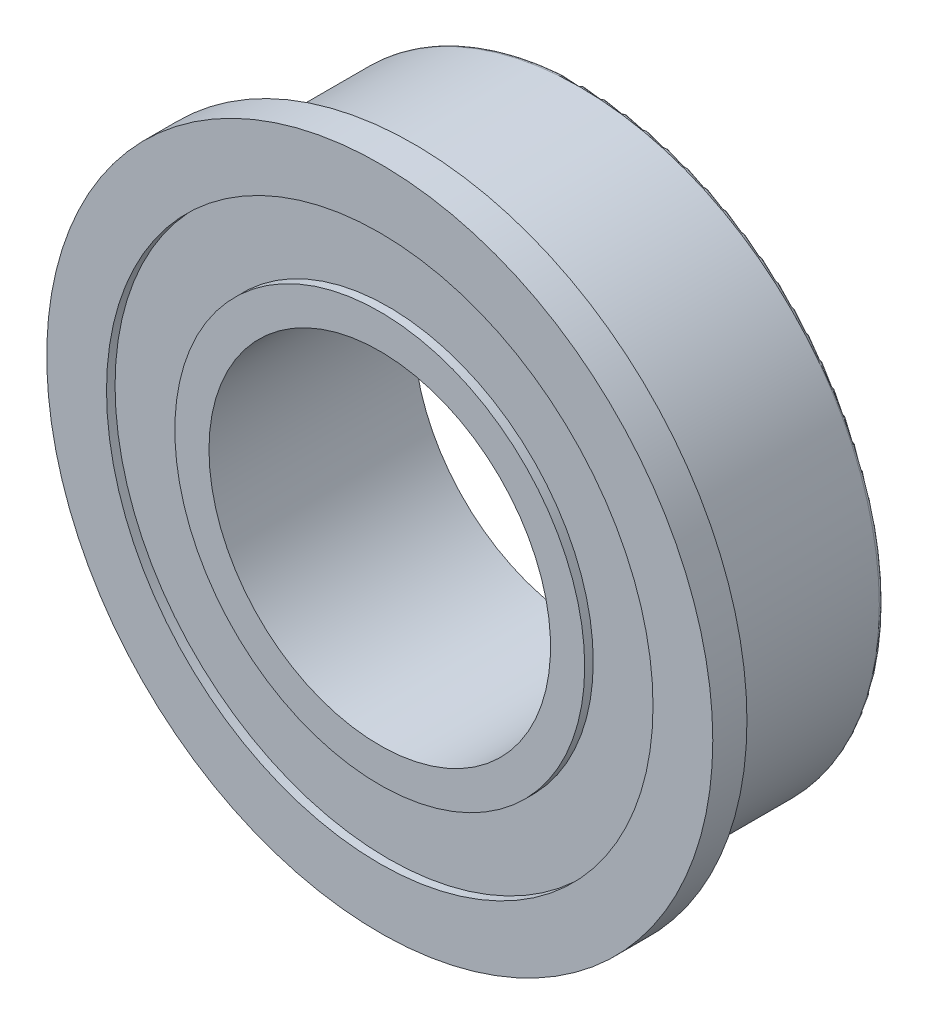
ISO-10303-21;
HEADER;
FILE_DESCRIPTION(('STEP AP214'),'2;1');
FILE_NAME('part.step','',(''),(''),'','','');
FILE_SCHEMA(('AUTOMOTIVE_DESIGN { 1 0 10303 214 1 1 1 1 }'));
ENDSEC;
DATA;
#1=APPLICATION_CONTEXT('core data for automotive mechanical design processes');
#2=APPLICATION_PROTOCOL_DEFINITION('international standard','automotive_design',2000,#1);
#3=PRODUCT_CONTEXT('',#1,'mechanical');
#4=PRODUCT('Part','Part','',(#3));
#5=PRODUCT_RELATED_PRODUCT_CATEGORY('part','',(#4));
#6=PRODUCT_DEFINITION_FORMATION('','',#4);
#7=PRODUCT_DEFINITION_CONTEXT('part definition',#1,'design');
#8=PRODUCT_DEFINITION('design','',#6,#7);
#9=PRODUCT_DEFINITION_SHAPE('','',#8);
#10=(LENGTH_UNIT() NAMED_UNIT(*) SI_UNIT(.MILLI.,.METRE.));
#11=(NAMED_UNIT(*) PLANE_ANGLE_UNIT() SI_UNIT($,.RADIAN.));
#12=(NAMED_UNIT(*) SI_UNIT($,.STERADIAN.) SOLID_ANGLE_UNIT());
#13=UNCERTAINTY_MEASURE_WITH_UNIT(LENGTH_MEASURE(1.E-05),#10,'distance_accuracy_value','');
#14=(GEOMETRIC_REPRESENTATION_CONTEXT(3) GLOBAL_UNCERTAINTY_ASSIGNED_CONTEXT((#13)) GLOBAL_UNIT_ASSIGNED_CONTEXT((#10,
#11,#12)) REPRESENTATION_CONTEXT('',''));
#15=CARTESIAN_POINT('',(0.,0.,0.));
#16=DIRECTION('',(0.,0.,1.));
#17=DIRECTION('',(1.,0.,0.));
#18=AXIS2_PLACEMENT_3D('',#15,#16,#17);
#19=CARTESIAN_POINT('',(0.,0.,4.8));
#20=DIRECTION('',(0.,0.,1.));
#21=DIRECTION('',(1.,0.,0.));
#22=AXIS2_PLACEMENT_3D('',#19,#20,#21);
#23=PLANE('',#22);
#24=CARTESIAN_POINT('',(0.,0.,4.8));
#25=DIRECTION('',(0.,0.,-1.));
#26=DIRECTION('',(-1.,0.,0.));
#27=AXIS2_PLACEMENT_3D('',#24,#25,#26);
#28=CIRCLE('',#27,4.);
#29=CARTESIAN_POINT('',(-4.,0.,4.8));
#30=VERTEX_POINT('',#29);
#31=EDGE_CURVE('E54',#30,#30,#28,.T.);
#32=ORIENTED_EDGE('',*,*,#31,.T.);
#33=EDGE_LOOP('',(#32));
#34=FACE_BOUND('',#33,.T.);
#35=CARTESIAN_POINT('',(0.,0.,4.8));
#36=DIRECTION('',(0.,0.,1.));
#37=DIRECTION('',(1.,0.,0.));
#38=AXIS2_PLACEMENT_3D('',#35,#36,#37);
#39=CIRCLE('',#38,4.8);
#40=CARTESIAN_POINT('',(4.8,0.,4.8));
#41=VERTEX_POINT('',#40);
#42=EDGE_CURVE('E81',#41,#41,#39,.T.);
#43=ORIENTED_EDGE('',*,*,#42,.T.);
#44=EDGE_LOOP('',(#43));
#45=FACE_BOUND('',#44,.T.);
#46=ADVANCED_FACE('F33',(#34,#45),#23,.T.);
#47=CARTESIAN_POINT('',(0.,0.,0.));
#48=DIRECTION('',(0.,0.,1.));
#49=DIRECTION('',(1.,0.,0.));
#50=AXIS2_PLACEMENT_3D('',#47,#48,#49);
#51=PLANE('',#50);
#52=CARTESIAN_POINT('',(0.,0.,0.));
#53=DIRECTION('',(0.,0.,-1.));
#54=DIRECTION('',(-1.,0.,0.));
#55=AXIS2_PLACEMENT_3D('',#52,#53,#54);
#56=CIRCLE('',#55,4.);
#57=CARTESIAN_POINT('',(-4.,0.,0.));
#58=VERTEX_POINT('',#57);
#59=EDGE_CURVE('E57',#58,#58,#56,.T.);
#60=ORIENTED_EDGE('',*,*,#59,.F.);
#61=EDGE_LOOP('',(#60));
#62=FACE_BOUND('',#61,.T.);
#63=CARTESIAN_POINT('',(0.,0.,0.));
#64=DIRECTION('',(0.,0.,-1.));
#65=DIRECTION('',(-1.,0.,0.));
#66=AXIS2_PLACEMENT_3D('',#63,#64,#65);
#67=CIRCLE('',#66,4.8);
#68=CARTESIAN_POINT('',(-4.8,0.,0.));
#69=VERTEX_POINT('',#68);
#70=EDGE_CURVE('E69',#69,#69,#67,.T.);
#71=ORIENTED_EDGE('',*,*,#70,.T.);
#72=EDGE_LOOP('',(#71));
#73=FACE_BOUND('',#72,.T.);
#74=ADVANCED_FACE('F124',(#62,#73),#51,.F.);
#75=CARTESIAN_POINT('',(0.,0.,4.8));
#76=DIRECTION('',(0.,0.,-1.));
#77=DIRECTION('',(-1.,0.,0.));
#78=AXIS2_PLACEMENT_3D('',#75,#76,#77);
#79=CYLINDRICAL_SURFACE('',#78,7.);
#80=CARTESIAN_POINT('',(0.,0.,0.1));
#81=DIRECTION('',(0.,0.,1.));
#82=DIRECTION('',(1.,0.,0.));
#83=AXIS2_PLACEMENT_3D('',#80,#81,#82);
#84=CIRCLE('',#83,7.);
#85=CARTESIAN_POINT('',(7.,0.,0.1));
#86=VERTEX_POINT('',#85);
#87=EDGE_CURVE('E40',#86,#86,#84,.T.);
#88=ORIENTED_EDGE('',*,*,#87,.T.);
#89=EDGE_LOOP('',(#88));
#90=FACE_BOUND('',#89,.T.);
#91=CARTESIAN_POINT('',(0.,0.,4.));
#92=DIRECTION('',(0.,0.,1.));
#93=DIRECTION('',(1.,0.,0.));
#94=AXIS2_PLACEMENT_3D('',#91,#92,#93);
#95=CIRCLE('',#94,7.);
#96=CARTESIAN_POINT('',(7.,0.,4.));
#97=VERTEX_POINT('',#96);
#98=EDGE_CURVE('E44',#97,#97,#95,.T.);
#99=ORIENTED_EDGE('',*,*,#98,.F.);
#100=EDGE_LOOP('',(#99));
#101=FACE_BOUND('',#100,.T.);
#102=ADVANCED_FACE('F122',(#90,#101),#79,.T.);
#103=CARTESIAN_POINT('',(0.,0.,0.));
#104=DIRECTION('',(0.,0.,1.));
#105=DIRECTION('',(1.,0.,0.));
#106=AXIS2_PLACEMENT_3D('',#103,#104,#105);
#107=CIRCLE('',#106,6.9);
#108=CARTESIAN_POINT('',(6.9,0.,0.));
#109=VERTEX_POINT('',#108);
#110=EDGE_CURVE('E10',#109,#109,#107,.F.);
#111=ORIENTED_EDGE('',*,*,#110,.T.);
#112=EDGE_LOOP('',(#111));
#113=FACE_BOUND('',#112,.T.);
#114=CARTESIAN_POINT('',(0.,0.,0.));
#115=DIRECTION('',(0.,0.,-1.));
#116=DIRECTION('',(-1.,0.,0.));
#117=AXIS2_PLACEMENT_3D('',#114,#115,#116);
#118=CIRCLE('',#117,6.2);
#119=CARTESIAN_POINT('',(-6.2,0.,0.));
#120=VERTEX_POINT('',#119);
#121=EDGE_CURVE('E63',#120,#120,#118,.T.);
#122=ORIENTED_EDGE('',*,*,#121,.F.);
#123=EDGE_LOOP('',(#122));
#124=FACE_BOUND('',#123,.T.);
#125=ADVANCED_FACE('F113',(#113,#124),#51,.F.);
#126=CARTESIAN_POINT('',(0.,0.,4.));
#127=DIRECTION('',(0.,0.,1.));
#128=DIRECTION('',(1.,0.,0.));
#129=AXIS2_PLACEMENT_3D('',#126,#127,#128);
#130=CYLINDRICAL_SURFACE('',#129,7.8);
#131=CARTESIAN_POINT('',(0.,0.,4.));
#132=DIRECTION('',(0.,0.,1.));
#133=DIRECTION('',(1.,0.,0.));
#134=AXIS2_PLACEMENT_3D('',#131,#132,#133);
#135=CIRCLE('',#134,7.8);
#136=CARTESIAN_POINT('',(7.8,0.,4.));
#137=VERTEX_POINT('',#136);
#138=EDGE_CURVE('E48',#137,#137,#135,.T.);
#139=ORIENTED_EDGE('',*,*,#138,.T.);
#140=EDGE_LOOP('',(#139));
#141=FACE_BOUND('',#140,.T.);
#142=CARTESIAN_POINT('',(0.,0.,4.8));
#143=DIRECTION('',(0.,0.,1.));
#144=DIRECTION('',(1.,0.,0.));
#145=AXIS2_PLACEMENT_3D('',#142,#143,#144);
#146=CIRCLE('',#145,7.8);
#147=CARTESIAN_POINT('',(7.8,0.,4.8));
#148=VERTEX_POINT('',#147);
#149=EDGE_CURVE('E51',#148,#148,#146,.T.);
#150=ORIENTED_EDGE('',*,*,#149,.F.);
#151=EDGE_LOOP('',(#150));
#152=FACE_BOUND('',#151,.T.);
#153=ADVANCED_FACE('F111',(#141,#152),#130,.T.);
#154=CARTESIAN_POINT('',(0.,0.,4.));
#155=DIRECTION('',(0.,0.,1.));
#156=DIRECTION('',(1.,0.,0.));
#157=AXIS2_PLACEMENT_3D('',#154,#155,#156);
#158=PLANE('',#157);
#159=ORIENTED_EDGE('',*,*,#98,.T.);
#160=EDGE_LOOP('',(#159));
#161=FACE_BOUND('',#160,.T.);
#162=ORIENTED_EDGE('',*,*,#138,.F.);
#163=EDGE_LOOP('',(#162));
#164=FACE_BOUND('',#163,.T.);
#165=ADVANCED_FACE('F107',(#161,#164),#158,.F.);
#166=CARTESIAN_POINT('',(0.,0.,4.8));
#167=DIRECTION('',(0.,0.,1.));
#168=DIRECTION('',(1.,0.,0.));
#169=AXIS2_PLACEMENT_3D('',#166,#167,#168);
#170=CIRCLE('',#169,6.4);
#171=CARTESIAN_POINT('',(6.4,0.,4.8));
#172=VERTEX_POINT('',#171);
#173=EDGE_CURVE('E75',#172,#172,#170,.T.);
#174=ORIENTED_EDGE('',*,*,#173,.F.);
#175=EDGE_LOOP('',(#174));
#176=FACE_BOUND('',#175,.T.);
#177=ORIENTED_EDGE('',*,*,#149,.T.);
#178=EDGE_LOOP('',(#177));
#179=FACE_BOUND('',#178,.T.);
#180=ADVANCED_FACE('F103',(#176,#179),#23,.T.);
#181=CARTESIAN_POINT('',(0.,0.,4.8));
#182=DIRECTION('',(0.,0.,-1.));
#183=DIRECTION('',(-1.,0.,0.));
#184=AXIS2_PLACEMENT_3D('',#181,#182,#183);
#185=CYLINDRICAL_SURFACE('',#184,4.);
#186=ORIENTED_EDGE('',*,*,#31,.F.);
#187=EDGE_LOOP('',(#186));
#188=FACE_BOUND('',#187,.T.);
#189=ORIENTED_EDGE('',*,*,#59,.T.);
#190=EDGE_LOOP('',(#189));
#191=FACE_BOUND('',#190,.T.);
#192=ADVANCED_FACE('F106',(#188,#191),#185,.F.);
#193=CARTESIAN_POINT('',(0.,0.,0.2));
#194=DIRECTION('',(0.,0.,-1.));
#195=DIRECTION('',(-1.,0.,0.));
#196=AXIS2_PLACEMENT_3D('',#193,#194,#195);
#197=CYLINDRICAL_SURFACE('',#196,6.2);
#198=CARTESIAN_POINT('',(0.,0.,0.2));
#199=DIRECTION('',(0.,0.,-1.));
#200=DIRECTION('',(-1.,0.,0.));
#201=AXIS2_PLACEMENT_3D('',#198,#199,#200);
#202=CIRCLE('',#201,6.2);
#203=CARTESIAN_POINT('',(-6.2,0.,0.2));
#204=VERTEX_POINT('',#203);
#205=EDGE_CURVE('E60',#204,#204,#202,.T.);
#206=ORIENTED_EDGE('',*,*,#205,.F.);
#207=EDGE_LOOP('',(#206));
#208=FACE_BOUND('',#207,.T.);
#209=ORIENTED_EDGE('',*,*,#121,.T.);
#210=EDGE_LOOP('',(#209));
#211=FACE_BOUND('',#210,.T.);
#212=ADVANCED_FACE('F186',(#208,#211),#197,.F.);
#213=CARTESIAN_POINT('',(0.,0.,0.2));
#214=DIRECTION('',(0.,0.,-1.));
#215=DIRECTION('',(-1.,0.,0.));
#216=AXIS2_PLACEMENT_3D('',#213,#214,#215);
#217=PLANE('',#216);
#218=CARTESIAN_POINT('',(0.,0.,0.2));
#219=DIRECTION('',(0.,0.,-1.));
#220=DIRECTION('',(-1.,0.,0.));
#221=AXIS2_PLACEMENT_3D('',#218,#219,#220);
#222=CIRCLE('',#221,4.8);
#223=CARTESIAN_POINT('',(-4.8,0.,0.2));
#224=VERTEX_POINT('',#223);
#225=EDGE_CURVE('E66',#224,#224,#222,.T.);
#226=ORIENTED_EDGE('',*,*,#225,.F.);
#227=EDGE_LOOP('',(#226));
#228=FACE_BOUND('',#227,.T.);
#229=ORIENTED_EDGE('',*,*,#205,.T.);
#230=EDGE_LOOP('',(#229));
#231=FACE_BOUND('',#230,.T.);
#232=ADVANCED_FACE('F178',(#228,#231),#217,.T.);
#233=CARTESIAN_POINT('',(0.,0.,0.2));
#234=DIRECTION('',(0.,0.,-1.));
#235=DIRECTION('',(-1.,0.,0.));
#236=AXIS2_PLACEMENT_3D('',#233,#234,#235);
#237=CYLINDRICAL_SURFACE('',#236,4.8);
#238=ORIENTED_EDGE('',*,*,#225,.T.);
#239=EDGE_LOOP('',(#238));
#240=FACE_BOUND('',#239,.T.);
#241=ORIENTED_EDGE('',*,*,#70,.F.);
#242=EDGE_LOOP('',(#241));
#243=FACE_BOUND('',#242,.T.);
#244=ADVANCED_FACE('F99',(#240,#243),#237,.T.);
#245=CARTESIAN_POINT('',(0.,0.,4.6));
#246=DIRECTION('',(0.,0.,1.));
#247=DIRECTION('',(1.,0.,0.));
#248=AXIS2_PLACEMENT_3D('',#245,#246,#247);
#249=CYLINDRICAL_SURFACE('',#248,6.4);
#250=CARTESIAN_POINT('',(0.,0.,4.6));
#251=DIRECTION('',(0.,0.,1.));
#252=DIRECTION('',(1.,0.,0.));
#253=AXIS2_PLACEMENT_3D('',#250,#251,#252);
#254=CIRCLE('',#253,6.4);
#255=CARTESIAN_POINT('',(6.4,0.,4.6));
#256=VERTEX_POINT('',#255);
#257=EDGE_CURVE('E72',#256,#256,#254,.T.);
#258=ORIENTED_EDGE('',*,*,#257,.F.);
#259=EDGE_LOOP('',(#258));
#260=FACE_BOUND('',#259,.T.);
#261=ORIENTED_EDGE('',*,*,#173,.T.);
#262=EDGE_LOOP('',(#261));
#263=FACE_BOUND('',#262,.T.);
#264=ADVANCED_FACE('F93',(#260,#263),#249,.F.);
#265=CARTESIAN_POINT('',(0.,0.,4.6));
#266=DIRECTION('',(0.,0.,1.));
#267=DIRECTION('',(1.,0.,0.));
#268=AXIS2_PLACEMENT_3D('',#265,#266,#267);
#269=PLANE('',#268);
#270=CARTESIAN_POINT('',(0.,0.,4.6));
#271=DIRECTION('',(0.,0.,1.));
#272=DIRECTION('',(1.,0.,0.));
#273=AXIS2_PLACEMENT_3D('',#270,#271,#272);
#274=CIRCLE('',#273,4.8);
#275=CARTESIAN_POINT('',(4.8,0.,4.6));
#276=VERTEX_POINT('',#275);
#277=EDGE_CURVE('E78',#276,#276,#274,.T.);
#278=ORIENTED_EDGE('',*,*,#277,.F.);
#279=EDGE_LOOP('',(#278));
#280=FACE_BOUND('',#279,.T.);
#281=ORIENTED_EDGE('',*,*,#257,.T.);
#282=EDGE_LOOP('',(#281));
#283=FACE_BOUND('',#282,.T.);
#284=ADVANCED_FACE('F90',(#280,#283),#269,.T.);
#285=CARTESIAN_POINT('',(0.,0.,4.6));
#286=DIRECTION('',(0.,0.,1.));
#287=DIRECTION('',(1.,0.,0.));
#288=AXIS2_PLACEMENT_3D('',#285,#286,#287);
#289=CYLINDRICAL_SURFACE('',#288,4.8);
#290=ORIENTED_EDGE('',*,*,#277,.T.);
#291=EDGE_LOOP('',(#290));
#292=FACE_BOUND('',#291,.T.);
#293=ORIENTED_EDGE('',*,*,#42,.F.);
#294=EDGE_LOOP('',(#293));
#295=FACE_BOUND('',#294,.T.);
#296=ADVANCED_FACE('F87',(#292,#295),#289,.T.);
#297=CARTESIAN_POINT('',(0.,0.,0.1));
#298=DIRECTION('',(0.,0.,1.));
#299=DIRECTION('',(1.,0.,0.));
#300=AXIS2_PLACEMENT_3D('',#297,#298,#299);
#301=TOROIDAL_SURFACE('',#300,6.9,0.1);
#302=ORIENTED_EDGE('',*,*,#110,.F.);
#303=EDGE_LOOP('',(#302));
#304=FACE_BOUND('',#303,.T.);
#305=ORIENTED_EDGE('',*,*,#87,.F.);
#306=EDGE_LOOP('',(#305));
#307=FACE_BOUND('',#306,.T.);
#308=ADVANCED_FACE('F35',(#304,#307),#301,.T.);
#309=CLOSED_SHELL('',(#46,#74,#102,#125,#153,#165,#180,#192,#212,#232,#244,#264,#284,#296,#308));
#310=MANIFOLD_SOLID_BREP('B2',#309);
#311=ADVANCED_BREP_SHAPE_REPRESENTATION('',(#18,#310),#14);
#312=SHAPE_DEFINITION_REPRESENTATION(#9,#311);
ENDSEC;
END-ISO-10303-21;
